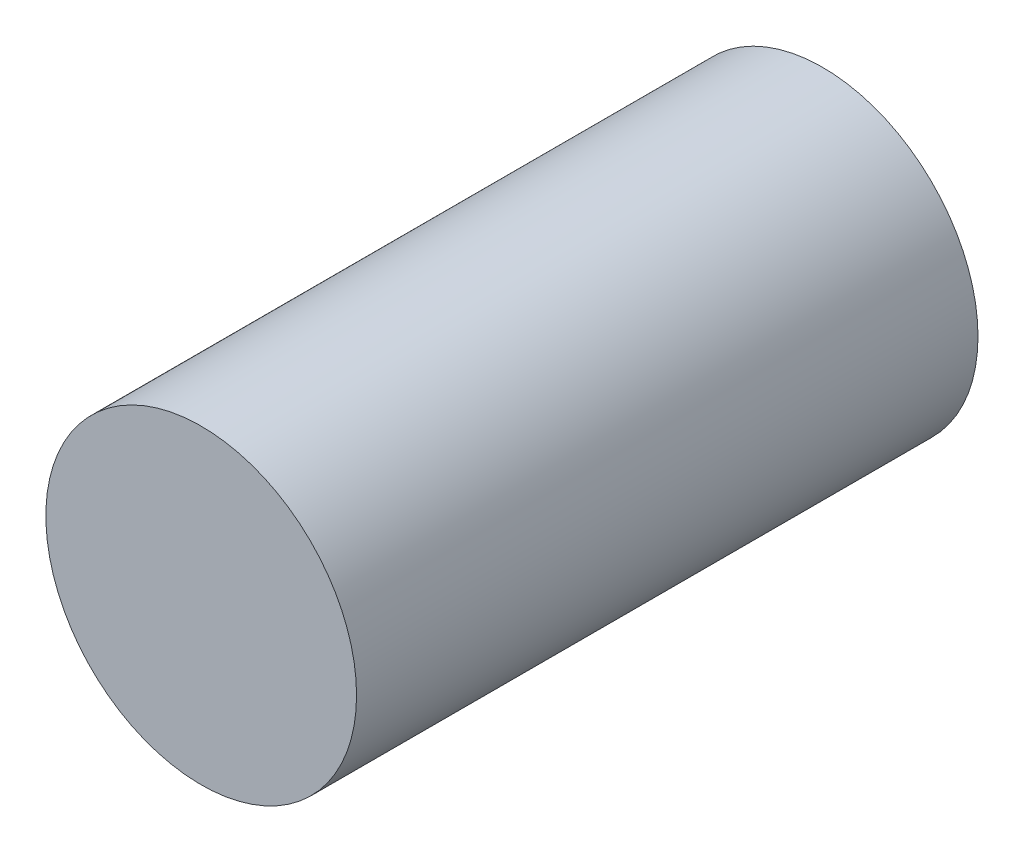
ISO-10303-21;
HEADER;
FILE_DESCRIPTION(('STEP AP214'),'2;1');
FILE_NAME('part.step','',(''),(''),'','','');
FILE_SCHEMA(('AUTOMOTIVE_DESIGN { 1 0 10303 214 1 1 1 1 }'));
ENDSEC;
DATA;
#1=APPLICATION_CONTEXT('core data for automotive mechanical design processes');
#2=APPLICATION_PROTOCOL_DEFINITION('international standard','automotive_design',2000,#1);
#3=PRODUCT_CONTEXT('',#1,'mechanical');
#4=PRODUCT('Part','Part','',(#3));
#5=PRODUCT_RELATED_PRODUCT_CATEGORY('part','',(#4));
#6=PRODUCT_DEFINITION_FORMATION('','',#4);
#7=PRODUCT_DEFINITION_CONTEXT('part definition',#1,'design');
#8=PRODUCT_DEFINITION('design','',#6,#7);
#9=PRODUCT_DEFINITION_SHAPE('','',#8);
#10=(LENGTH_UNIT() NAMED_UNIT(*) SI_UNIT(.MILLI.,.METRE.));
#11=(NAMED_UNIT(*) PLANE_ANGLE_UNIT() SI_UNIT($,.RADIAN.));
#12=(NAMED_UNIT(*) SI_UNIT($,.STERADIAN.) SOLID_ANGLE_UNIT());
#13=UNCERTAINTY_MEASURE_WITH_UNIT(LENGTH_MEASURE(1.E-05),#10,'distance_accuracy_value','');
#14=(GEOMETRIC_REPRESENTATION_CONTEXT(3) GLOBAL_UNCERTAINTY_ASSIGNED_CONTEXT((#13)) GLOBAL_UNIT_ASSIGNED_CONTEXT((#10,
#11,#12)) REPRESENTATION_CONTEXT('',''));
#15=CARTESIAN_POINT('',(0.,0.,0.));
#16=DIRECTION('',(0.,0.,1.));
#17=DIRECTION('',(1.,0.,0.));
#18=AXIS2_PLACEMENT_3D('',#15,#16,#17);
#19=CARTESIAN_POINT('',(0.,0.,34.));
#20=DIRECTION('',(0.,0.,-1.));
#21=DIRECTION('',(-1.,0.,0.));
#22=AXIS2_PLACEMENT_3D('',#19,#20,#21);
#23=CYLINDRICAL_SURFACE('',#22,8.5);
#24=CARTESIAN_POINT('',(0.,0.,34.));
#25=DIRECTION('',(0.,0.,1.));
#26=DIRECTION('',(1.,0.,0.));
#27=AXIS2_PLACEMENT_3D('',#24,#25,#26);
#28=CIRCLE('',#27,8.5);
#29=CARTESIAN_POINT('',(8.5,0.,34.));
#30=VERTEX_POINT('',#29);
#31=EDGE_CURVE('E10',#30,#30,#28,.T.);
#32=ORIENTED_EDGE('',*,*,#31,.F.);
#33=EDGE_LOOP('',(#32));
#34=FACE_BOUND('',#33,.T.);
#35=CARTESIAN_POINT('',(0.,0.,0.));
#36=DIRECTION('',(0.,0.,1.));
#37=DIRECTION('',(1.,0.,0.));
#38=AXIS2_PLACEMENT_3D('',#35,#36,#37);
#39=CIRCLE('',#38,8.5);
#40=CARTESIAN_POINT('',(8.5,0.,0.));
#41=VERTEX_POINT('',#40);
#42=EDGE_CURVE('E33',#41,#41,#39,.T.);
#43=ORIENTED_EDGE('',*,*,#42,.T.);
#44=EDGE_LOOP('',(#43));
#45=FACE_BOUND('',#44,.T.);
#46=ADVANCED_FACE('F30',(#34,#45),#23,.T.);
#47=CARTESIAN_POINT('',(0.,0.,34.));
#48=DIRECTION('',(0.,0.,1.));
#49=DIRECTION('',(1.,0.,0.));
#50=AXIS2_PLACEMENT_3D('',#47,#48,#49);
#51=PLANE('',#50);
#52=ORIENTED_EDGE('',*,*,#31,.T.);
#53=EDGE_LOOP('',(#52));
#54=FACE_BOUND('',#53,.T.);
#55=ADVANCED_FACE('F45',(#54),#51,.T.);
#56=CARTESIAN_POINT('',(0.,0.,0.));
#57=DIRECTION('',(0.,0.,1.));
#58=DIRECTION('',(1.,0.,0.));
#59=AXIS2_PLACEMENT_3D('',#56,#57,#58);
#60=PLANE('',#59);
#61=ORIENTED_EDGE('',*,*,#42,.F.);
#62=EDGE_LOOP('',(#61));
#63=FACE_BOUND('',#62,.T.);
#64=ADVANCED_FACE('F43',(#63),#60,.F.);
#65=CLOSED_SHELL('',(#46,#55,#64));
#66=MANIFOLD_SOLID_BREP('B2',#65);
#67=ADVANCED_BREP_SHAPE_REPRESENTATION('',(#18,#66),#14);
#68=SHAPE_DEFINITION_REPRESENTATION(#9,#67);
ENDSEC;
END-ISO-10303-21;
